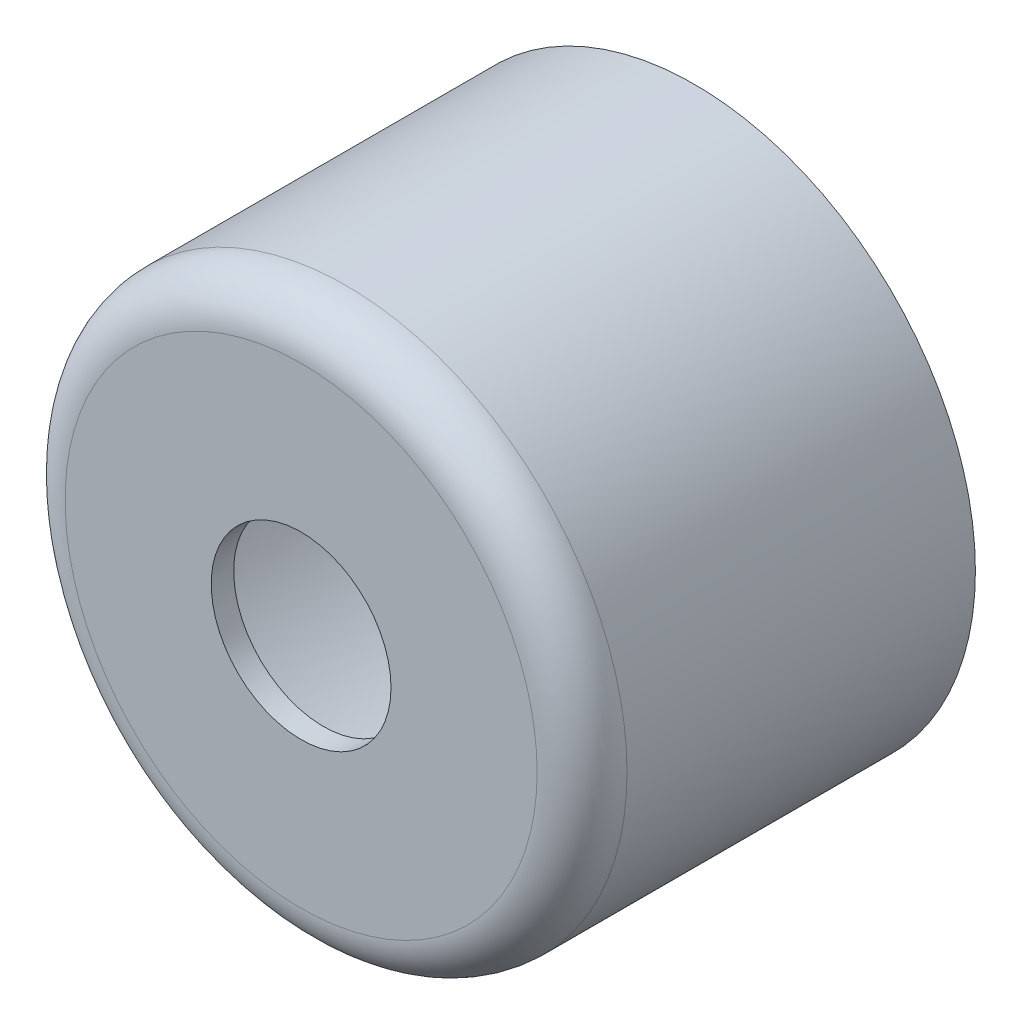
ISO-10303-21;
HEADER;
FILE_DESCRIPTION(('STEP AP214'),'2;1');
FILE_NAME('part.step','',(''),(''),'','','');
FILE_SCHEMA(('AUTOMOTIVE_DESIGN { 1 0 10303 214 1 1 1 1 }'));
ENDSEC;
DATA;
#1=APPLICATION_CONTEXT('core data for automotive mechanical design processes');
#2=APPLICATION_PROTOCOL_DEFINITION('international standard','automotive_design',2000,#1);
#3=PRODUCT_CONTEXT('',#1,'mechanical');
#4=PRODUCT('Part','Part','',(#3));
#5=PRODUCT_RELATED_PRODUCT_CATEGORY('part','',(#4));
#6=PRODUCT_DEFINITION_FORMATION('','',#4);
#7=PRODUCT_DEFINITION_CONTEXT('part definition',#1,'design');
#8=PRODUCT_DEFINITION('design','',#6,#7);
#9=PRODUCT_DEFINITION_SHAPE('','',#8);
#10=(LENGTH_UNIT() NAMED_UNIT(*) SI_UNIT(.MILLI.,.METRE.));
#11=(NAMED_UNIT(*) PLANE_ANGLE_UNIT() SI_UNIT($,.RADIAN.));
#12=(NAMED_UNIT(*) SI_UNIT($,.STERADIAN.) SOLID_ANGLE_UNIT());
#13=UNCERTAINTY_MEASURE_WITH_UNIT(LENGTH_MEASURE(1.E-05),#10,'distance_accuracy_value','');
#14=(GEOMETRIC_REPRESENTATION_CONTEXT(3) GLOBAL_UNCERTAINTY_ASSIGNED_CONTEXT((#13)) GLOBAL_UNIT_ASSIGNED_CONTEXT((#10,
#11,#12)) REPRESENTATION_CONTEXT('',''));
#15=CARTESIAN_POINT('',(0.,0.,0.));
#16=DIRECTION('',(0.,0.,1.));
#17=DIRECTION('',(1.,0.,0.));
#18=AXIS2_PLACEMENT_3D('',#15,#16,#17);
#19=CARTESIAN_POINT('',(0.,0.,17.5));
#20=DIRECTION('',(0.,0.,-1.));
#21=DIRECTION('',(-1.,0.,0.));
#22=AXIS2_PLACEMENT_3D('',#19,#20,#21);
#23=CYLINDRICAL_SURFACE('',#22,12.5);
#24=CARTESIAN_POINT('',(0.,0.,15.5));
#25=DIRECTION('',(0.,0.,1.));
#26=DIRECTION('',(1.,0.,0.));
#27=AXIS2_PLACEMENT_3D('',#24,#25,#26);
#28=CIRCLE('',#27,12.5);
#29=CARTESIAN_POINT('',(12.5,0.,15.5));
#30=VERTEX_POINT('',#29);
#31=EDGE_CURVE('E10',#30,#30,#28,.F.);
#32=ORIENTED_EDGE('',*,*,#31,.T.);
#33=EDGE_LOOP('',(#32));
#34=FACE_BOUND('',#33,.T.);
#35=CARTESIAN_POINT('',(0.,0.,0.));
#36=DIRECTION('',(0.,0.,1.));
#37=DIRECTION('',(1.,0.,0.));
#38=AXIS2_PLACEMENT_3D('',#35,#36,#37);
#39=CIRCLE('',#38,12.5);
#40=CARTESIAN_POINT('',(12.5,0.,0.));
#41=VERTEX_POINT('',#40);
#42=EDGE_CURVE('E45',#41,#41,#39,.T.);
#43=ORIENTED_EDGE('',*,*,#42,.T.);
#44=EDGE_LOOP('',(#43));
#45=FACE_BOUND('',#44,.T.);
#46=ADVANCED_FACE('F33',(#34,#45),#23,.T.);
#47=CARTESIAN_POINT('',(0.,0.,17.5));
#48=DIRECTION('',(0.,0.,1.));
#49=DIRECTION('',(1.,0.,0.));
#50=AXIS2_PLACEMENT_3D('',#47,#48,#49);
#51=PLANE('',#50);
#52=CARTESIAN_POINT('',(0.,0.,17.5));
#53=DIRECTION('',(0.,0.,1.));
#54=DIRECTION('',(1.,0.,0.));
#55=AXIS2_PLACEMENT_3D('',#52,#53,#54);
#56=CIRCLE('',#55,4.);
#57=CARTESIAN_POINT('',(4.,0.,17.5));
#58=VERTEX_POINT('',#57);
#59=EDGE_CURVE('E59',#58,#58,#56,.T.);
#60=ORIENTED_EDGE('',*,*,#59,.F.);
#61=EDGE_LOOP('',(#60));
#62=FACE_BOUND('',#61,.T.);
#63=CARTESIAN_POINT('',(0.,0.,17.5));
#64=DIRECTION('',(0.,0.,1.));
#65=DIRECTION('',(1.,0.,0.));
#66=AXIS2_PLACEMENT_3D('',#63,#64,#65);
#67=CIRCLE('',#66,10.5);
#68=CARTESIAN_POINT('',(10.5,0.,17.5));
#69=VERTEX_POINT('',#68);
#70=EDGE_CURVE('E41',#69,#69,#67,.T.);
#71=ORIENTED_EDGE('',*,*,#70,.T.);
#72=EDGE_LOOP('',(#71));
#73=FACE_BOUND('',#72,.T.);
#74=ADVANCED_FACE('F80',(#62,#73),#51,.T.);
#75=CARTESIAN_POINT('',(0.,0.,0.));
#76=DIRECTION('',(0.,0.,1.));
#77=DIRECTION('',(1.,0.,0.));
#78=AXIS2_PLACEMENT_3D('',#75,#76,#77);
#79=PLANE('',#78);
#80=CARTESIAN_POINT('',(0.,0.,0.));
#81=DIRECTION('',(0.,0.,1.));
#82=DIRECTION('',(1.,0.,0.));
#83=AXIS2_PLACEMENT_3D('',#80,#81,#82);
#84=CIRCLE('',#83,11.5);
#85=CARTESIAN_POINT('',(11.5,0.,0.));
#86=VERTEX_POINT('',#85);
#87=EDGE_CURVE('E51',#86,#86,#84,.T.);
#88=ORIENTED_EDGE('',*,*,#87,.T.);
#89=EDGE_LOOP('',(#88));
#90=FACE_BOUND('',#89,.T.);
#91=ORIENTED_EDGE('',*,*,#42,.F.);
#92=EDGE_LOOP('',(#91));
#93=FACE_BOUND('',#92,.T.);
#94=ADVANCED_FACE('F84',(#90,#93),#79,.F.);
#95=CARTESIAN_POINT('',(0.,0.,15.5));
#96=DIRECTION('',(0.,0.,1.));
#97=DIRECTION('',(1.,0.,0.));
#98=AXIS2_PLACEMENT_3D('',#95,#96,#97);
#99=TOROIDAL_SURFACE('',#98,10.5,2.);
#100=ORIENTED_EDGE('',*,*,#31,.F.);
#101=EDGE_LOOP('',(#100));
#102=FACE_BOUND('',#101,.T.);
#103=ORIENTED_EDGE('',*,*,#70,.F.);
#104=EDGE_LOOP('',(#103));
#105=FACE_BOUND('',#104,.T.);
#106=ADVANCED_FACE('F35',(#102,#105),#99,.T.);
#107=CARTESIAN_POINT('',(0.,0.,17.5));
#108=DIRECTION('',(0.,0.,-1.));
#109=DIRECTION('',(-1.,0.,0.));
#110=AXIS2_PLACEMENT_3D('',#107,#108,#109);
#111=CYLINDRICAL_SURFACE('',#110,11.5);
#112=CARTESIAN_POINT('',(0.,0.,15.5));
#113=DIRECTION('',(0.,0.,-1.));
#114=DIRECTION('',(-1.,0.,0.));
#115=AXIS2_PLACEMENT_3D('',#112,#113,#114);
#116=CIRCLE('',#115,11.5);
#117=CARTESIAN_POINT('',(-11.5,0.,15.5));
#118=VERTEX_POINT('',#117);
#119=EDGE_CURVE('E50',#118,#118,#116,.T.);
#120=ORIENTED_EDGE('',*,*,#119,.F.);
#121=EDGE_LOOP('',(#120));
#122=FACE_BOUND('',#121,.T.);
#123=ORIENTED_EDGE('',*,*,#87,.F.);
#124=EDGE_LOOP('',(#123));
#125=FACE_BOUND('',#124,.T.);
#126=ADVANCED_FACE('F93',(#122,#125),#111,.F.);
#127=CARTESIAN_POINT('',(0.,0.,16.5));
#128=DIRECTION('',(0.,0.,1.));
#129=DIRECTION('',(1.,0.,0.));
#130=AXIS2_PLACEMENT_3D('',#127,#128,#129);
#131=PLANE('',#130);
#132=CARTESIAN_POINT('',(0.,0.,16.5));
#133=DIRECTION('',(0.,0.,1.));
#134=DIRECTION('',(1.,0.,0.));
#135=AXIS2_PLACEMENT_3D('',#132,#133,#134);
#136=CIRCLE('',#135,4.);
#137=CARTESIAN_POINT('',(4.,0.,16.5));
#138=VERTEX_POINT('',#137);
#139=EDGE_CURVE('E37',#138,#138,#136,.T.);
#140=ORIENTED_EDGE('',*,*,#139,.T.);
#141=EDGE_LOOP('',(#140));
#142=FACE_BOUND('',#141,.T.);
#143=CARTESIAN_POINT('',(0.,0.,16.5));
#144=DIRECTION('',(0.,0.,1.));
#145=DIRECTION('',(1.,0.,0.));
#146=AXIS2_PLACEMENT_3D('',#143,#144,#145);
#147=CIRCLE('',#146,10.5);
#148=CARTESIAN_POINT('',(10.5,0.,16.5));
#149=VERTEX_POINT('',#148);
#150=EDGE_CURVE('E54',#149,#149,#147,.T.);
#151=ORIENTED_EDGE('',*,*,#150,.F.);
#152=EDGE_LOOP('',(#151));
#153=FACE_BOUND('',#152,.T.);
#154=ADVANCED_FACE('F66',(#142,#153),#131,.F.);
#155=CARTESIAN_POINT('',(0.,0.,15.5));
#156=DIRECTION('',(0.,0.,1.));
#157=DIRECTION('',(1.,0.,0.));
#158=AXIS2_PLACEMENT_3D('',#155,#156,#157);
#159=TOROIDAL_SURFACE('',#158,10.5,1.);
#160=ORIENTED_EDGE('',*,*,#119,.T.);
#161=EDGE_LOOP('',(#160));
#162=FACE_BOUND('',#161,.T.);
#163=ORIENTED_EDGE('',*,*,#150,.T.);
#164=EDGE_LOOP('',(#163));
#165=FACE_BOUND('',#164,.T.);
#166=ADVANCED_FACE('F71',(#162,#165),#159,.F.);
#167=CARTESIAN_POINT('',(0.,0.,0.));
#168=DIRECTION('',(0.,0.,1.));
#169=DIRECTION('',(1.,0.,0.));
#170=AXIS2_PLACEMENT_3D('',#167,#168,#169);
#171=CYLINDRICAL_SURFACE('',#170,4.);
#172=ORIENTED_EDGE('',*,*,#59,.T.);
#173=EDGE_LOOP('',(#172));
#174=FACE_BOUND('',#173,.T.);
#175=ORIENTED_EDGE('',*,*,#139,.F.);
#176=EDGE_LOOP('',(#175));
#177=FACE_BOUND('',#176,.T.);
#178=ADVANCED_FACE('F69',(#174,#177),#171,.F.);
#179=CLOSED_SHELL('',(#46,#74,#94,#106,#126,#154,#166,#178));
#180=MANIFOLD_SOLID_BREP('B2',#179);
#181=ADVANCED_BREP_SHAPE_REPRESENTATION('',(#18,#180),#14);
#182=SHAPE_DEFINITION_REPRESENTATION(#9,#181);
ENDSEC;
END-ISO-10303-21;
